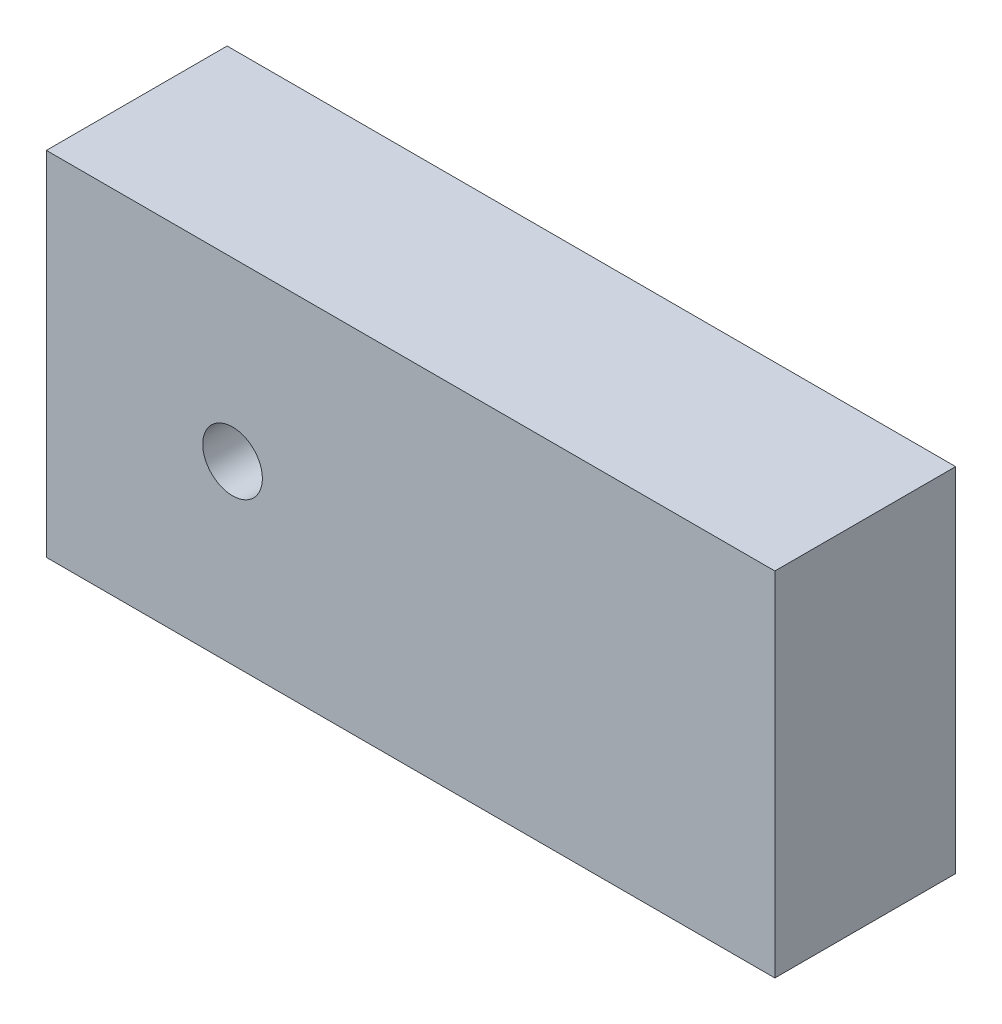
ISO-10303-21;
HEADER;
FILE_DESCRIPTION(('STEP AP214'),'2;1');
FILE_NAME('part.step','',(''),(''),'','','');
FILE_SCHEMA(('AUTOMOTIVE_DESIGN { 1 0 10303 214 1 1 1 1 }'));
ENDSEC;
DATA;
#1=APPLICATION_CONTEXT('core data for automotive mechanical design processes');
#2=APPLICATION_PROTOCOL_DEFINITION('international standard','automotive_design',2000,#1);
#3=PRODUCT_CONTEXT('',#1,'mechanical');
#4=PRODUCT('Part','Part','',(#3));
#5=PRODUCT_RELATED_PRODUCT_CATEGORY('part','',(#4));
#6=PRODUCT_DEFINITION_FORMATION('','',#4);
#7=PRODUCT_DEFINITION_CONTEXT('part definition',#1,'design');
#8=PRODUCT_DEFINITION('design','',#6,#7);
#9=PRODUCT_DEFINITION_SHAPE('','',#8);
#10=(LENGTH_UNIT() NAMED_UNIT(*) SI_UNIT(.MILLI.,.METRE.));
#11=(NAMED_UNIT(*) PLANE_ANGLE_UNIT() SI_UNIT($,.RADIAN.));
#12=(NAMED_UNIT(*) SI_UNIT($,.STERADIAN.) SOLID_ANGLE_UNIT());
#13=UNCERTAINTY_MEASURE_WITH_UNIT(LENGTH_MEASURE(1.E-05),#10,'distance_accuracy_value','');
#14=(GEOMETRIC_REPRESENTATION_CONTEXT(3) GLOBAL_UNCERTAINTY_ASSIGNED_CONTEXT((#13)) GLOBAL_UNIT_ASSIGNED_CONTEXT((#10,
#11,#12)) REPRESENTATION_CONTEXT('',''));
#15=CARTESIAN_POINT('',(0.,0.,0.));
#16=DIRECTION('',(0.,0.,1.));
#17=DIRECTION('',(1.,0.,0.));
#18=AXIS2_PLACEMENT_3D('',#15,#16,#17);
#19=CARTESIAN_POINT('',(0.,0.,10.));
#20=DIRECTION('',(0.,0.,-1.));
#21=DIRECTION('',(-1.,0.,0.));
#22=AXIS2_PLACEMENT_3D('',#19,#20,#21);
#23=PLANE('',#22);
#24=DIRECTION('',(0.,1.,0.));
#25=VECTOR('',#24,1.);
#26=CARTESIAN_POINT('',(20.15,-9.75,10.));
#27=LINE('',#26,#25);
#28=CARTESIAN_POINT('',(20.15,-9.75,10.));
#29=VERTEX_POINT('',#28);
#30=CARTESIAN_POINT('',(20.15,9.75,10.));
#31=VERTEX_POINT('',#30);
#32=EDGE_CURVE('E85',#29,#31,#27,.T.);
#33=ORIENTED_EDGE('',*,*,#32,.T.);
#34=DIRECTION('',(-1.,0.,0.));
#35=VECTOR('',#34,1.);
#36=CARTESIAN_POINT('',(-20.15,9.75,10.));
#37=LINE('',#36,#35);
#38=CARTESIAN_POINT('',(-20.15,9.75,10.));
#39=VERTEX_POINT('',#38);
#40=EDGE_CURVE('E80',#31,#39,#37,.T.);
#41=ORIENTED_EDGE('',*,*,#40,.T.);
#42=DIRECTION('',(0.,-1.,0.));
#43=VECTOR('',#42,1.);
#44=CARTESIAN_POINT('',(-20.15,-9.75,10.));
#45=LINE('',#44,#43);
#46=CARTESIAN_POINT('',(-20.15,-9.75,10.));
#47=VERTEX_POINT('',#46);
#48=EDGE_CURVE('E83',#39,#47,#45,.T.);
#49=ORIENTED_EDGE('',*,*,#48,.T.);
#50=DIRECTION('',(1.,0.,0.));
#51=VECTOR('',#50,1.);
#52=CARTESIAN_POINT('',(-20.15,-9.75,10.));
#53=LINE('',#52,#51);
#54=EDGE_CURVE('E50',#47,#29,#53,.T.);
#55=ORIENTED_EDGE('',*,*,#54,.T.);
#56=EDGE_LOOP('',(#33,#41,#49,#55));
#57=FACE_BOUND('',#56,.T.);
#58=CARTESIAN_POINT('',(-9.85,0.,10.));
#59=DIRECTION('',(0.,0.,1.));
#60=DIRECTION('',(1.,0.,0.));
#61=AXIS2_PLACEMENT_3D('',#58,#59,#60);
#62=CIRCLE('',#61,1.65);
#63=CARTESIAN_POINT('',(-8.2,0.,10.));
#64=VERTEX_POINT('',#63);
#65=EDGE_CURVE('E100',#64,#64,#62,.T.);
#66=ORIENTED_EDGE('',*,*,#65,.F.);
#67=EDGE_LOOP('',(#66));
#68=FACE_BOUND('',#67,.T.);
#69=ADVANCED_FACE('F33',(#57,#68),#23,.F.);
#70=CARTESIAN_POINT('',(0.,0.,0.));
#71=DIRECTION('',(0.,0.,-1.));
#72=DIRECTION('',(-1.,0.,0.));
#73=AXIS2_PLACEMENT_3D('',#70,#71,#72);
#74=PLANE('',#73);
#75=DIRECTION('',(0.,1.,0.));
#76=VECTOR('',#75,1.);
#77=CARTESIAN_POINT('',(20.15,-9.75,0.));
#78=LINE('',#77,#76);
#79=CARTESIAN_POINT('',(20.15,-9.75,0.));
#80=VERTEX_POINT('',#79);
#81=CARTESIAN_POINT('',(20.15,9.75,0.));
#82=VERTEX_POINT('',#81);
#83=EDGE_CURVE('E97',#80,#82,#78,.T.);
#84=ORIENTED_EDGE('',*,*,#83,.F.);
#85=DIRECTION('',(1.,0.,0.));
#86=VECTOR('',#85,1.);
#87=CARTESIAN_POINT('',(-20.15,-9.75,0.));
#88=LINE('',#87,#86);
#89=CARTESIAN_POINT('',(-20.15,-9.75,0.));
#90=VERTEX_POINT('',#89);
#91=EDGE_CURVE('E73',#90,#80,#88,.T.);
#92=ORIENTED_EDGE('',*,*,#91,.F.);
#93=DIRECTION('',(0.,-1.,0.));
#94=VECTOR('',#93,1.);
#95=CARTESIAN_POINT('',(-20.15,-9.75,0.));
#96=LINE('',#95,#94);
#97=CARTESIAN_POINT('',(-20.15,9.75,0.));
#98=VERTEX_POINT('',#97);
#99=EDGE_CURVE('E67',#98,#90,#96,.T.);
#100=ORIENTED_EDGE('',*,*,#99,.F.);
#101=DIRECTION('',(-1.,0.,0.));
#102=VECTOR('',#101,1.);
#103=CARTESIAN_POINT('',(-20.15,9.75,0.));
#104=LINE('',#103,#102);
#105=EDGE_CURVE('E89',#82,#98,#104,.T.);
#106=ORIENTED_EDGE('',*,*,#105,.F.);
#107=EDGE_LOOP('',(#84,#92,#100,#106));
#108=FACE_BOUND('',#107,.T.);
#109=CARTESIAN_POINT('',(-9.85,0.,0.));
#110=DIRECTION('',(0.,0.,1.));
#111=DIRECTION('',(1.,0.,0.));
#112=AXIS2_PLACEMENT_3D('',#109,#110,#111);
#113=CIRCLE('',#112,1.65);
#114=CARTESIAN_POINT('',(-8.2,0.,0.));
#115=VERTEX_POINT('',#114);
#116=EDGE_CURVE('E112',#115,#115,#113,.T.);
#117=ORIENTED_EDGE('',*,*,#116,.T.);
#118=EDGE_LOOP('',(#117));
#119=FACE_BOUND('',#118,.T.);
#120=ADVANCED_FACE('F108',(#108,#119),#74,.T.);
#121=CARTESIAN_POINT('',(20.15,-9.75,10.));
#122=DIRECTION('',(-1.,0.,0.));
#123=DIRECTION('',(0.,0.,1.));
#124=AXIS2_PLACEMENT_3D('',#121,#122,#123);
#125=PLANE('',#124);
#126=ORIENTED_EDGE('',*,*,#83,.T.);
#127=DIRECTION('',(0.,0.,-1.));
#128=VECTOR('',#127,1.);
#129=CARTESIAN_POINT('',(20.15,9.75,10.));
#130=LINE('',#129,#128);
#131=EDGE_CURVE('E11',#31,#82,#130,.T.);
#132=ORIENTED_EDGE('',*,*,#131,.F.);
#133=ORIENTED_EDGE('',*,*,#32,.F.);
#134=DIRECTION('',(0.,0.,-1.));
#135=VECTOR('',#134,1.);
#136=CARTESIAN_POINT('',(20.15,-9.75,10.));
#137=LINE('',#136,#135);
#138=EDGE_CURVE('E93',#29,#80,#137,.T.);
#139=ORIENTED_EDGE('',*,*,#138,.T.);
#140=EDGE_LOOP('',(#126,#132,#133,#139));
#141=FACE_BOUND('',#140,.T.);
#142=ADVANCED_FACE('F35',(#141),#125,.F.);
#143=CARTESIAN_POINT('',(-20.15,9.75,10.));
#144=DIRECTION('',(0.,-1.,0.));
#145=DIRECTION('',(0.,0.,-1.));
#146=AXIS2_PLACEMENT_3D('',#143,#144,#145);
#147=PLANE('',#146);
#148=ORIENTED_EDGE('',*,*,#105,.T.);
#149=DIRECTION('',(0.,0.,-1.));
#150=VECTOR('',#149,1.);
#151=CARTESIAN_POINT('',(-20.15,9.75,10.));
#152=LINE('',#151,#150);
#153=EDGE_CURVE('E42',#39,#98,#152,.T.);
#154=ORIENTED_EDGE('',*,*,#153,.F.);
#155=ORIENTED_EDGE('',*,*,#40,.F.);
#156=ORIENTED_EDGE('',*,*,#131,.T.);
#157=EDGE_LOOP('',(#148,#154,#155,#156));
#158=FACE_BOUND('',#157,.T.);
#159=ADVANCED_FACE('F88',(#158),#147,.F.);
#160=CARTESIAN_POINT('',(-20.15,-9.75,10.));
#161=DIRECTION('',(1.,0.,0.));
#162=DIRECTION('',(0.,0.,-1.));
#163=AXIS2_PLACEMENT_3D('',#160,#161,#162);
#164=PLANE('',#163);
#165=ORIENTED_EDGE('',*,*,#99,.T.);
#166=DIRECTION('',(0.,0.,-1.));
#167=VECTOR('',#166,1.);
#168=CARTESIAN_POINT('',(-20.15,-9.75,10.));
#169=LINE('',#168,#167);
#170=EDGE_CURVE('E90',#47,#90,#169,.T.);
#171=ORIENTED_EDGE('',*,*,#170,.F.);
#172=ORIENTED_EDGE('',*,*,#48,.F.);
#173=ORIENTED_EDGE('',*,*,#153,.T.);
#174=EDGE_LOOP('',(#165,#171,#172,#173));
#175=FACE_BOUND('',#174,.T.);
#176=ADVANCED_FACE('F91',(#175),#164,.F.);
#177=CARTESIAN_POINT('',(-20.15,-9.75,10.));
#178=DIRECTION('',(0.,1.,0.));
#179=DIRECTION('',(0.,0.,1.));
#180=AXIS2_PLACEMENT_3D('',#177,#178,#179);
#181=PLANE('',#180);
#182=ORIENTED_EDGE('',*,*,#91,.T.);
#183=ORIENTED_EDGE('',*,*,#138,.F.);
#184=ORIENTED_EDGE('',*,*,#54,.F.);
#185=ORIENTED_EDGE('',*,*,#170,.T.);
#186=EDGE_LOOP('',(#182,#183,#184,#185));
#187=FACE_BOUND('',#186,.T.);
#188=ADVANCED_FACE('F105',(#187),#181,.F.);
#189=CARTESIAN_POINT('',(-9.85,0.,10.));
#190=DIRECTION('',(0.,0.,-1.));
#191=DIRECTION('',(-1.,0.,0.));
#192=AXIS2_PLACEMENT_3D('',#189,#190,#191);
#193=CYLINDRICAL_SURFACE('',#192,1.65);
#194=ORIENTED_EDGE('',*,*,#65,.T.);
#195=EDGE_LOOP('',(#194));
#196=FACE_BOUND('',#195,.T.);
#197=ORIENTED_EDGE('',*,*,#116,.F.);
#198=EDGE_LOOP('',(#197));
#199=FACE_BOUND('',#198,.T.);
#200=ADVANCED_FACE('F118',(#196,#199),#193,.F.);
#201=CLOSED_SHELL('',(#69,#120,#142,#159,#176,#188,#200));
#202=MANIFOLD_SOLID_BREP('B2',#201);
#203=ADVANCED_BREP_SHAPE_REPRESENTATION('',(#18,#202),#14);
#204=SHAPE_DEFINITION_REPRESENTATION(#9,#203);
ENDSEC;
END-ISO-10303-21;
